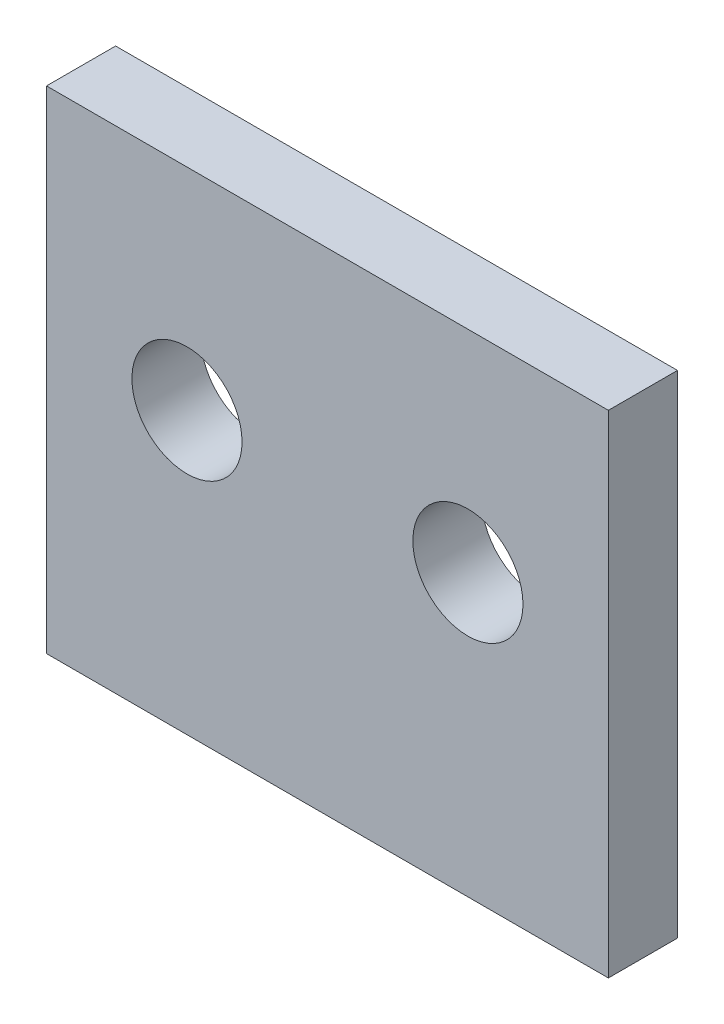
ISO-10303-21;
HEADER;
FILE_DESCRIPTION(('STEP AP214'),'2;1');
FILE_NAME('part.step','',(''),(''),'','','');
FILE_SCHEMA(('AUTOMOTIVE_DESIGN { 1 0 10303 214 1 1 1 1 }'));
ENDSEC;
DATA;
#1=APPLICATION_CONTEXT('core data for automotive mechanical design processes');
#2=APPLICATION_PROTOCOL_DEFINITION('international standard','automotive_design',2000,#1);
#3=PRODUCT_CONTEXT('',#1,'mechanical');
#4=PRODUCT('Part','Part','',(#3));
#5=PRODUCT_RELATED_PRODUCT_CATEGORY('part','',(#4));
#6=PRODUCT_DEFINITION_FORMATION('','',#4);
#7=PRODUCT_DEFINITION_CONTEXT('part definition',#1,'design');
#8=PRODUCT_DEFINITION('design','',#6,#7);
#9=PRODUCT_DEFINITION_SHAPE('','',#8);
#10=(LENGTH_UNIT() NAMED_UNIT(*) SI_UNIT(.MILLI.,.METRE.));
#11=(NAMED_UNIT(*) PLANE_ANGLE_UNIT() SI_UNIT($,.RADIAN.));
#12=(NAMED_UNIT(*) SI_UNIT($,.STERADIAN.) SOLID_ANGLE_UNIT());
#13=UNCERTAINTY_MEASURE_WITH_UNIT(LENGTH_MEASURE(1.E-05),#10,'distance_accuracy_value','');
#14=(GEOMETRIC_REPRESENTATION_CONTEXT(3) GLOBAL_UNCERTAINTY_ASSIGNED_CONTEXT((#13)) GLOBAL_UNIT_ASSIGNED_CONTEXT((#10,
#11,#12)) REPRESENTATION_CONTEXT('',''));
#15=CARTESIAN_POINT('',(0.,0.,0.));
#16=DIRECTION('',(0.,0.,1.));
#17=DIRECTION('',(1.,0.,0.));
#18=AXIS2_PLACEMENT_3D('',#15,#16,#17);
#19=CARTESIAN_POINT('',(0.,248.92,3.175));
#20=DIRECTION('',(0.,-1.,0.));
#21=DIRECTION('',(0.,0.,-1.));
#22=AXIS2_PLACEMENT_3D('',#19,#20,#21);
#23=PLANE('',#22);
#24=DIRECTION('',(0.,0.,-1.));
#25=VECTOR('',#24,1.);
#26=CARTESIAN_POINT('',(25.4,248.92,3.175));
#27=LINE('',#26,#25);
#28=CARTESIAN_POINT('',(25.4,248.92,3.175));
#29=VERTEX_POINT('',#28);
#30=CARTESIAN_POINT('',(25.4,248.92,0.0508000000000002));
#31=VERTEX_POINT('',#30);
#32=EDGE_CURVE('E58',#29,#31,#27,.T.);
#33=ORIENTED_EDGE('',*,*,#32,.T.);
#34=DIRECTION('',(-1.,0.,0.));
#35=VECTOR('',#34,1.);
#36=CARTESIAN_POINT('',(25.4,248.92,0.0508000000000002));
#37=LINE('',#36,#35);
#38=CARTESIAN_POINT('',(0.,248.92,0.0508000000000002));
#39=VERTEX_POINT('',#38);
#40=EDGE_CURVE('E51',#31,#39,#37,.T.);
#41=ORIENTED_EDGE('',*,*,#40,.T.);
#42=DIRECTION('',(0.,0.,-1.));
#43=VECTOR('',#42,1.);
#44=CARTESIAN_POINT('',(0.,248.92,3.175));
#45=LINE('',#44,#43);
#46=CARTESIAN_POINT('',(0.,248.92,3.175));
#47=VERTEX_POINT('',#46);
#48=EDGE_CURVE('E11',#47,#39,#45,.T.);
#49=ORIENTED_EDGE('',*,*,#48,.F.);
#50=DIRECTION('',(-1.,0.,0.));
#51=VECTOR('',#50,1.);
#52=CARTESIAN_POINT('',(0.,248.92,3.175));
#53=LINE('',#52,#51);
#54=EDGE_CURVE('E102',#29,#47,#53,.T.);
#55=ORIENTED_EDGE('',*,*,#54,.F.);
#56=EDGE_LOOP('',(#33,#41,#49,#55));
#57=FACE_BOUND('',#56,.T.);
#58=ADVANCED_FACE('F36',(#57),#23,.F.);
#59=CARTESIAN_POINT('',(0.,0.,3.175));
#60=DIRECTION('',(1.,0.,0.));
#61=DIRECTION('',(0.,1.,0.));
#62=AXIS2_PLACEMENT_3D('',#59,#60,#61);
#63=PLANE('',#62);
#64=ORIENTED_EDGE('',*,*,#48,.T.);
#65=DIRECTION('',(0.,1.,0.));
#66=VECTOR('',#65,1.);
#67=CARTESIAN_POINT('',(0.,226.695,0.0507999999999999));
#68=LINE('',#67,#66);
#69=CARTESIAN_POINT('',(0.,226.695,0.0507999999999999));
#70=VERTEX_POINT('',#69);
#71=EDGE_CURVE('E81',#70,#39,#68,.T.);
#72=ORIENTED_EDGE('',*,*,#71,.F.);
#73=DIRECTION('',(0.,0.,-1.));
#74=VECTOR('',#73,1.);
#75=CARTESIAN_POINT('',(0.,226.695,3.175));
#76=LINE('',#75,#74);
#77=CARTESIAN_POINT('',(0.,226.695,3.175));
#78=VERTEX_POINT('',#77);
#79=EDGE_CURVE('E44',#78,#70,#76,.T.);
#80=ORIENTED_EDGE('',*,*,#79,.F.);
#81=DIRECTION('',(0.,-1.,0.));
#82=VECTOR('',#81,1.);
#83=CARTESIAN_POINT('',(0.,0.,3.175));
#84=LINE('',#83,#82);
#85=EDGE_CURVE('E100',#47,#78,#84,.T.);
#86=ORIENTED_EDGE('',*,*,#85,.F.);
#87=EDGE_LOOP('',(#64,#72,#80,#86));
#88=FACE_BOUND('',#87,.T.);
#89=ADVANCED_FACE('F121',(#88),#63,.F.);
#90=CARTESIAN_POINT('',(0.,226.695,3.175));
#91=DIRECTION('',(0.,-1.,0.));
#92=DIRECTION('',(0.,0.,-1.));
#93=AXIS2_PLACEMENT_3D('',#90,#91,#92);
#94=PLANE('',#93);
#95=DIRECTION('',(-1.,0.,0.));
#96=VECTOR('',#95,1.);
#97=CARTESIAN_POINT('',(25.4,226.695,0.0507999999999999));
#98=LINE('',#97,#96);
#99=CARTESIAN_POINT('',(25.4,226.695,0.0507999999999999));
#100=VERTEX_POINT('',#99);
#101=EDGE_CURVE('E78',#100,#70,#98,.T.);
#102=ORIENTED_EDGE('',*,*,#101,.F.);
#103=DIRECTION('',(0.,0.,-1.));
#104=VECTOR('',#103,1.);
#105=CARTESIAN_POINT('',(25.4,226.695,3.175));
#106=LINE('',#105,#104);
#107=CARTESIAN_POINT('',(25.4,226.695,3.175));
#108=VERTEX_POINT('',#107);
#109=EDGE_CURVE('E87',#108,#100,#106,.T.);
#110=ORIENTED_EDGE('',*,*,#109,.F.);
#111=DIRECTION('',(-1.,0.,0.));
#112=VECTOR('',#111,1.);
#113=CARTESIAN_POINT('',(0.,226.695,3.175));
#114=LINE('',#113,#112);
#115=EDGE_CURVE('E98',#108,#78,#114,.T.);
#116=ORIENTED_EDGE('',*,*,#115,.T.);
#117=ORIENTED_EDGE('',*,*,#79,.T.);
#118=EDGE_LOOP('',(#102,#110,#116,#117));
#119=FACE_BOUND('',#118,.T.);
#120=ADVANCED_FACE('F85',(#119),#94,.T.);
#121=CARTESIAN_POINT('',(6.34999999999999,239.395,3.175));
#122=DIRECTION('',(0.,0.,-1.));
#123=DIRECTION('',(-1.,0.,0.));
#124=AXIS2_PLACEMENT_3D('',#121,#122,#123);
#125=CYLINDRICAL_SURFACE('',#124,2.48920000000011);
#126=CARTESIAN_POINT('',(6.34999999999999,239.395,0.0508000000000002));
#127=DIRECTION('',(0.,0.,1.));
#128=DIRECTION('',(0.,-1.,0.));
#129=AXIS2_PLACEMENT_3D('',#126,#127,#128);
#130=CIRCLE('',#129,2.48920000000011);
#131=CARTESIAN_POINT('',(6.34999999999999,236.9058,0.0508000000000001));
#132=VERTEX_POINT('',#131);
#133=EDGE_CURVE('E111',#132,#132,#130,.T.);
#134=ORIENTED_EDGE('',*,*,#133,.F.);
#135=EDGE_LOOP('',(#134));
#136=FACE_BOUND('',#135,.T.);
#137=CARTESIAN_POINT('',(6.34999999999999,239.395,3.175));
#138=DIRECTION('',(0.,0.,1.));
#139=DIRECTION('',(1.,0.,0.));
#140=AXIS2_PLACEMENT_3D('',#137,#138,#139);
#141=CIRCLE('',#140,2.48920000000011);
#142=CARTESIAN_POINT('',(8.8392000000001,239.395,3.175));
#143=VERTEX_POINT('',#142);
#144=EDGE_CURVE('E105',#143,#143,#141,.T.);
#145=ORIENTED_EDGE('',*,*,#144,.T.);
#146=EDGE_LOOP('',(#145));
#147=FACE_BOUND('',#146,.T.);
#148=ADVANCED_FACE('F143',(#136,#147),#125,.F.);
#149=CARTESIAN_POINT('',(19.05,239.395,3.175));
#150=DIRECTION('',(0.,0.,-1.));
#151=DIRECTION('',(-1.,0.,0.));
#152=AXIS2_PLACEMENT_3D('',#149,#150,#151);
#153=CYLINDRICAL_SURFACE('',#152,2.48920000000013);
#154=CARTESIAN_POINT('',(19.05,239.395,0.0508000000000002));
#155=DIRECTION('',(0.,0.,1.));
#156=DIRECTION('',(0.,-1.,0.));
#157=AXIS2_PLACEMENT_3D('',#154,#155,#156);
#158=CIRCLE('',#157,2.48920000000013);
#159=CARTESIAN_POINT('',(19.05,236.9058,0.0508000000000001));
#160=VERTEX_POINT('',#159);
#161=EDGE_CURVE('E114',#160,#160,#158,.T.);
#162=ORIENTED_EDGE('',*,*,#161,.F.);
#163=EDGE_LOOP('',(#162));
#164=FACE_BOUND('',#163,.T.);
#165=CARTESIAN_POINT('',(19.05,239.395,3.175));
#166=DIRECTION('',(0.,0.,1.));
#167=DIRECTION('',(1.,0.,0.));
#168=AXIS2_PLACEMENT_3D('',#165,#166,#167);
#169=CIRCLE('',#168,2.48920000000013);
#170=CARTESIAN_POINT('',(21.5392000000001,239.395,3.175));
#171=VERTEX_POINT('',#170);
#172=EDGE_CURVE('E108',#171,#171,#169,.T.);
#173=ORIENTED_EDGE('',*,*,#172,.T.);
#174=EDGE_LOOP('',(#173));
#175=FACE_BOUND('',#174,.T.);
#176=ADVANCED_FACE('F38',(#164,#175),#153,.F.);
#177=CARTESIAN_POINT('',(25.4,0.,3.175));
#178=DIRECTION('',(1.,0.,0.));
#179=DIRECTION('',(0.,1.,0.));
#180=AXIS2_PLACEMENT_3D('',#177,#178,#179);
#181=PLANE('',#180);
#182=DIRECTION('',(0.,1.,0.));
#183=VECTOR('',#182,1.);
#184=CARTESIAN_POINT('',(25.4,226.695,0.0507999999999999));
#185=LINE('',#184,#183);
#186=EDGE_CURVE('E75',#100,#31,#185,.T.);
#187=ORIENTED_EDGE('',*,*,#186,.T.);
#188=ORIENTED_EDGE('',*,*,#32,.F.);
#189=DIRECTION('',(0.,-1.,0.));
#190=VECTOR('',#189,1.);
#191=CARTESIAN_POINT('',(25.4,0.,3.175));
#192=LINE('',#191,#190);
#193=EDGE_CURVE('E93',#29,#108,#192,.T.);
#194=ORIENTED_EDGE('',*,*,#193,.T.);
#195=ORIENTED_EDGE('',*,*,#109,.T.);
#196=EDGE_LOOP('',(#187,#188,#194,#195));
#197=FACE_BOUND('',#196,.T.);
#198=ADVANCED_FACE('F91',(#197),#181,.T.);
#199=CARTESIAN_POINT('',(0.,0.,3.175));
#200=DIRECTION('',(0.,0.,1.));
#201=DIRECTION('',(1.,0.,0.));
#202=AXIS2_PLACEMENT_3D('',#199,#200,#201);
#203=PLANE('',#202);
#204=ORIENTED_EDGE('',*,*,#172,.F.);
#205=EDGE_LOOP('',(#204));
#206=FACE_BOUND('',#205,.T.);
#207=ORIENTED_EDGE('',*,*,#144,.F.);
#208=EDGE_LOOP('',(#207));
#209=FACE_BOUND('',#208,.T.);
#210=ORIENTED_EDGE('',*,*,#54,.T.);
#211=ORIENTED_EDGE('',*,*,#85,.T.);
#212=ORIENTED_EDGE('',*,*,#115,.F.);
#213=ORIENTED_EDGE('',*,*,#193,.F.);
#214=EDGE_LOOP('',(#210,#211,#212,#213));
#215=FACE_BOUND('',#214,.T.);
#216=ADVANCED_FACE('F123',(#206,#209,#215),#203,.T.);
#217=CARTESIAN_POINT('',(25.4,226.695,0.0507999999999999));
#218=DIRECTION('',(0.,0.,1.));
#219=DIRECTION('',(0.,-1.,0.));
#220=AXIS2_PLACEMENT_3D('',#217,#218,#219);
#221=PLANE('',#220);
#222=ORIENTED_EDGE('',*,*,#133,.T.);
#223=EDGE_LOOP('',(#222));
#224=FACE_BOUND('',#223,.T.);
#225=ORIENTED_EDGE('',*,*,#161,.T.);
#226=EDGE_LOOP('',(#225));
#227=FACE_BOUND('',#226,.T.);
#228=ORIENTED_EDGE('',*,*,#71,.T.);
#229=ORIENTED_EDGE('',*,*,#40,.F.);
#230=ORIENTED_EDGE('',*,*,#186,.F.);
#231=ORIENTED_EDGE('',*,*,#101,.T.);
#232=EDGE_LOOP('',(#228,#229,#230,#231));
#233=FACE_BOUND('',#232,.T.);
#234=ADVANCED_FACE('F77',(#224,#227,#233),#221,.F.);
#235=CLOSED_SHELL('',(#58,#89,#120,#148,#176,#198,#216,#234));
#236=MANIFOLD_SOLID_BREP('B2',#235);
#237=ADVANCED_BREP_SHAPE_REPRESENTATION('',(#18,#236),#14);
#238=SHAPE_DEFINITION_REPRESENTATION(#9,#237);
ENDSEC;
END-ISO-10303-21;
